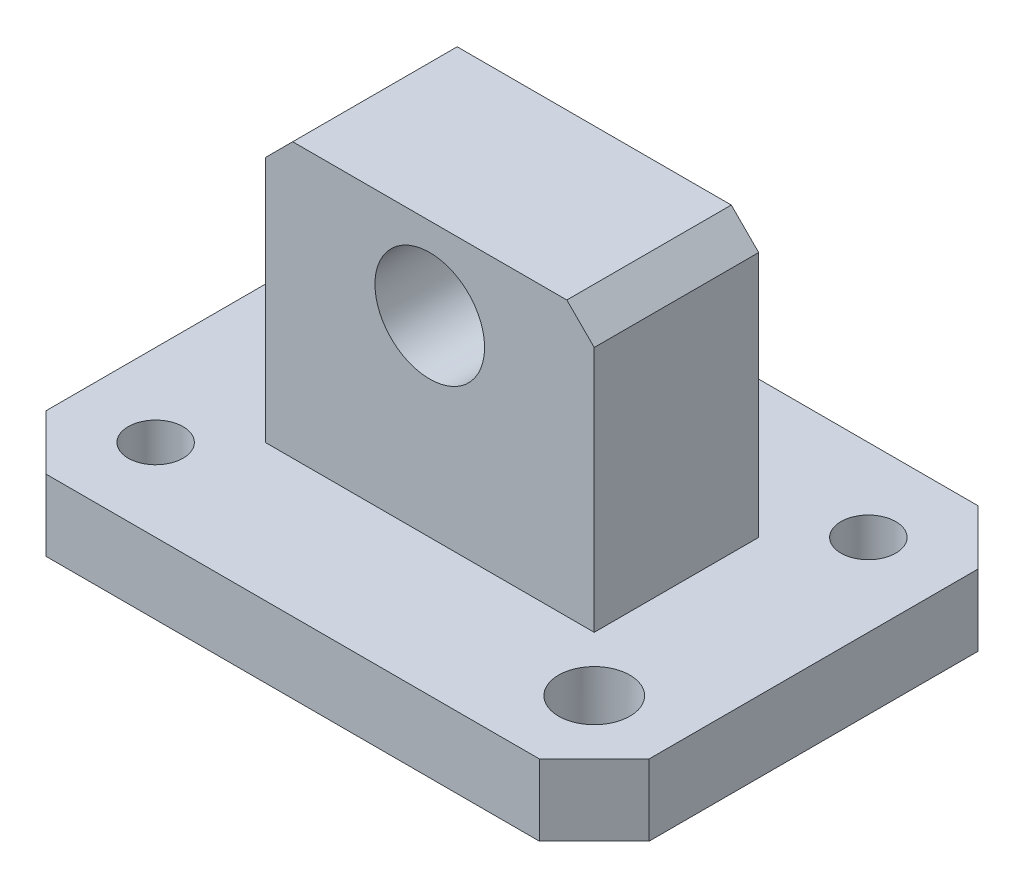
ISO-10303-21;
HEADER;
FILE_DESCRIPTION(('STEP AP214'),'2;1');
FILE_NAME('part.step','',(''),(''),'','','');
FILE_SCHEMA(('AUTOMOTIVE_DESIGN { 1 0 10303 214 1 1 1 1 }'));
ENDSEC;
DATA;
#1=APPLICATION_CONTEXT('core data for automotive mechanical design processes');
#2=APPLICATION_PROTOCOL_DEFINITION('international standard','automotive_design',2000,#1);
#3=PRODUCT_CONTEXT('',#1,'mechanical');
#4=PRODUCT('Part','Part','',(#3));
#5=PRODUCT_RELATED_PRODUCT_CATEGORY('part','',(#4));
#6=PRODUCT_DEFINITION_FORMATION('','',#4);
#7=PRODUCT_DEFINITION_CONTEXT('part definition',#1,'design');
#8=PRODUCT_DEFINITION('design','',#6,#7);
#9=PRODUCT_DEFINITION_SHAPE('','',#8);
#10=(LENGTH_UNIT() NAMED_UNIT(*) SI_UNIT(.MILLI.,.METRE.));
#11=(NAMED_UNIT(*) PLANE_ANGLE_UNIT() SI_UNIT($,.RADIAN.));
#12=(NAMED_UNIT(*) SI_UNIT($,.STERADIAN.) SOLID_ANGLE_UNIT());
#13=UNCERTAINTY_MEASURE_WITH_UNIT(LENGTH_MEASURE(1.E-05),#10,'distance_accuracy_value','');
#14=(GEOMETRIC_REPRESENTATION_CONTEXT(3) GLOBAL_UNCERTAINTY_ASSIGNED_CONTEXT((#13)) GLOBAL_UNIT_ASSIGNED_CONTEXT((#10,
#11,#12)) REPRESENTATION_CONTEXT('',''));
#15=CARTESIAN_POINT('',(0.,0.,0.));
#16=DIRECTION('',(0.,0.,1.));
#17=DIRECTION('',(1.,0.,0.));
#18=AXIS2_PLACEMENT_3D('',#15,#16,#17);
#19=CARTESIAN_POINT('',(0.,13.,0.));
#20=DIRECTION('',(0.,-1.,0.));
#21=DIRECTION('',(0.,0.,-1.));
#22=AXIS2_PLACEMENT_3D('',#19,#20,#21);
#23=PLANE('',#22);
#24=CARTESIAN_POINT('',(15.,13.,-15.));
#25=DIRECTION('',(0.,1.,0.));
#26=DIRECTION('',(0.,0.,1.));
#27=AXIS2_PLACEMENT_3D('',#24,#25,#26);
#28=CIRCLE('',#27,5.);
#29=CARTESIAN_POINT('',(15.,13.,-10.));
#30=VERTEX_POINT('',#29);
#31=EDGE_CURVE('E373',#30,#30,#28,.T.);
#32=ORIENTED_EDGE('',*,*,#31,.F.);
#33=EDGE_LOOP('',(#32));
#34=FACE_BOUND('',#33,.T.);
#35=CARTESIAN_POINT('',(95.,13.,-65.));
#36=DIRECTION('',(0.,1.,0.));
#37=DIRECTION('',(0.,0.,1.));
#38=AXIS2_PLACEMENT_3D('',#35,#36,#37);
#39=CIRCLE('',#38,5.00000000000001);
#40=CARTESIAN_POINT('',(95.,13.,-60.));
#41=VERTEX_POINT('',#40);
#42=EDGE_CURVE('E376',#41,#41,#39,.T.);
#43=ORIENTED_EDGE('',*,*,#42,.F.);
#44=EDGE_LOOP('',(#43));
#45=FACE_BOUND('',#44,.T.);
#46=CARTESIAN_POINT('',(95.,13.,-15.));
#47=DIRECTION('',(0.,1.,0.));
#48=DIRECTION('',(0.,0.,1.));
#49=AXIS2_PLACEMENT_3D('',#46,#47,#48);
#50=CIRCLE('',#49,6.5);
#51=CARTESIAN_POINT('',(95.,13.,-8.5));
#52=VERTEX_POINT('',#51);
#53=EDGE_CURVE('E372',#52,#52,#50,.T.);
#54=ORIENTED_EDGE('',*,*,#53,.F.);
#55=EDGE_LOOP('',(#54));
#56=FACE_BOUND('',#55,.T.);
#57=CARTESIAN_POINT('',(15.,13.,-65.));
#58=DIRECTION('',(0.,1.,0.));
#59=DIRECTION('',(0.,0.,1.));
#60=AXIS2_PLACEMENT_3D('',#57,#58,#59);
#61=CIRCLE('',#60,6.5);
#62=CARTESIAN_POINT('',(15.,13.,-58.5));
#63=VERTEX_POINT('',#62);
#64=EDGE_CURVE('E261',#63,#63,#61,.T.);
#65=ORIENTED_EDGE('',*,*,#64,.F.);
#66=EDGE_LOOP('',(#65));
#67=FACE_BOUND('',#66,.T.);
#68=DIRECTION('',(0.,0.,1.));
#69=VECTOR('',#68,1.);
#70=CARTESIAN_POINT('',(0.,13.,-10.));
#71=LINE('',#70,#69);
#72=CARTESIAN_POINT('',(0.,13.,-70.));
#73=VERTEX_POINT('',#72);
#74=CARTESIAN_POINT('',(0.,13.,-10.));
#75=VERTEX_POINT('',#74);
#76=EDGE_CURVE('E187',#73,#75,#71,.T.);
#77=ORIENTED_EDGE('',*,*,#76,.T.);
#78=DIRECTION('',(0.707106781186548,0.,0.707106781186548));
#79=VECTOR('',#78,1.);
#80=CARTESIAN_POINT('',(10.,13.,0.));
#81=LINE('',#80,#79);
#82=CARTESIAN_POINT('',(10.,13.,0.));
#83=VERTEX_POINT('',#82);
#84=EDGE_CURVE('E190',#75,#83,#81,.T.);
#85=ORIENTED_EDGE('',*,*,#84,.T.);
#86=DIRECTION('',(1.,0.,0.));
#87=VECTOR('',#86,1.);
#88=CARTESIAN_POINT('',(10.,13.,0.));
#89=LINE('',#88,#87);
#90=CARTESIAN_POINT('',(100.,13.,0.));
#91=VERTEX_POINT('',#90);
#92=EDGE_CURVE('E193',#83,#91,#89,.T.);
#93=ORIENTED_EDGE('',*,*,#92,.T.);
#94=DIRECTION('',(0.707106781186547,0.,-0.707106781186548));
#95=VECTOR('',#94,1.);
#96=CARTESIAN_POINT('',(100.,13.,0.));
#97=LINE('',#96,#95);
#98=CARTESIAN_POINT('',(110.,13.,-10.));
#99=VERTEX_POINT('',#98);
#100=EDGE_CURVE('E195',#91,#99,#97,.T.);
#101=ORIENTED_EDGE('',*,*,#100,.T.);
#102=DIRECTION('',(0.,0.,-1.));
#103=VECTOR('',#102,1.);
#104=CARTESIAN_POINT('',(110.,13.,-10.));
#105=LINE('',#104,#103);
#106=CARTESIAN_POINT('',(110.,13.,-70.));
#107=VERTEX_POINT('',#106);
#108=EDGE_CURVE('E197',#99,#107,#105,.T.);
#109=ORIENTED_EDGE('',*,*,#108,.T.);
#110=DIRECTION('',(-0.707106781186547,0.,-0.707106781186547));
#111=VECTOR('',#110,1.);
#112=CARTESIAN_POINT('',(110.,13.,-70.));
#113=LINE('',#112,#111);
#114=CARTESIAN_POINT('',(100.,13.,-80.));
#115=VERTEX_POINT('',#114);
#116=EDGE_CURVE('E199',#107,#115,#113,.T.);
#117=ORIENTED_EDGE('',*,*,#116,.T.);
#118=DIRECTION('',(-1.,0.,0.));
#119=VECTOR('',#118,1.);
#120=CARTESIAN_POINT('',(10.,13.,-80.));
#121=LINE('',#120,#119);
#122=CARTESIAN_POINT('',(10.,13.,-80.));
#123=VERTEX_POINT('',#122);
#124=EDGE_CURVE('E201',#115,#123,#121,.T.);
#125=ORIENTED_EDGE('',*,*,#124,.T.);
#126=DIRECTION('',(-0.707106781186548,0.,0.707106781186547));
#127=VECTOR('',#126,1.);
#128=CARTESIAN_POINT('',(0.,13.,-70.));
#129=LINE('',#128,#127);
#130=EDGE_CURVE('E203',#123,#73,#129,.T.);
#131=ORIENTED_EDGE('',*,*,#130,.T.);
#132=EDGE_LOOP('',(#77,#85,#93,#101,#109,#117,#125,#131));
#133=FACE_BOUND('',#132,.T.);
#134=DIRECTION('',(0.,0.,1.));
#135=VECTOR('',#134,1.);
#136=CARTESIAN_POINT('',(25.,13.,-55.));
#137=LINE('',#136,#135);
#138=CARTESIAN_POINT('',(25.,13.,-55.));
#139=VERTEX_POINT('',#138);
#140=CARTESIAN_POINT('',(25.,13.,-25.));
#141=VERTEX_POINT('',#140);
#142=EDGE_CURVE('E173',#139,#141,#137,.T.);
#143=ORIENTED_EDGE('',*,*,#142,.F.);
#144=DIRECTION('',(-1.,0.,0.));
#145=VECTOR('',#144,1.);
#146=CARTESIAN_POINT('',(25.,13.,-55.));
#147=LINE('',#146,#145);
#148=CARTESIAN_POINT('',(85.,13.,-55.));
#149=VERTEX_POINT('',#148);
#150=EDGE_CURVE('E169',#149,#139,#147,.T.);
#151=ORIENTED_EDGE('',*,*,#150,.F.);
#152=DIRECTION('',(0.,0.,-1.));
#153=VECTOR('',#152,1.);
#154=CARTESIAN_POINT('',(85.,13.,-55.));
#155=LINE('',#154,#153);
#156=CARTESIAN_POINT('',(85.,13.,-25.));
#157=VERTEX_POINT('',#156);
#158=EDGE_CURVE('E154',#157,#149,#155,.T.);
#159=ORIENTED_EDGE('',*,*,#158,.F.);
#160=DIRECTION('',(1.,0.,0.));
#161=VECTOR('',#160,1.);
#162=CARTESIAN_POINT('',(25.,13.,-25.));
#163=LINE('',#162,#161);
#164=EDGE_CURVE('E166',#141,#157,#163,.T.);
#165=ORIENTED_EDGE('',*,*,#164,.F.);
#166=EDGE_LOOP('',(#143,#151,#159,#165));
#167=FACE_BOUND('',#166,.T.);
#168=ADVANCED_FACE('F47',(#34,#45,#56,#67,#133,#167),#23,.F.);
#169=CARTESIAN_POINT('',(0.,13.,-10.));
#170=DIRECTION('',(1.,0.,0.));
#171=DIRECTION('',(0.,0.,-1.));
#172=AXIS2_PLACEMENT_3D('',#169,#170,#171);
#173=PLANE('',#172);
#174=DIRECTION('',(0.,0.,1.));
#175=VECTOR('',#174,1.);
#176=CARTESIAN_POINT('',(0.,0.,-10.));
#177=LINE('',#176,#175);
#178=CARTESIAN_POINT('',(0.,0.,-70.));
#179=VERTEX_POINT('',#178);
#180=CARTESIAN_POINT('',(0.,0.,-10.));
#181=VERTEX_POINT('',#180);
#182=EDGE_CURVE('E186',#179,#181,#177,.T.);
#183=ORIENTED_EDGE('',*,*,#182,.T.);
#184=DIRECTION('',(0.,-1.,0.));
#185=VECTOR('',#184,1.);
#186=CARTESIAN_POINT('',(0.,13.,-10.));
#187=LINE('',#186,#185);
#188=EDGE_CURVE('E241',#75,#181,#187,.T.);
#189=ORIENTED_EDGE('',*,*,#188,.F.);
#190=ORIENTED_EDGE('',*,*,#76,.F.);
#191=DIRECTION('',(0.,-1.,0.));
#192=VECTOR('',#191,1.);
#193=CARTESIAN_POINT('',(0.,13.,-70.));
#194=LINE('',#193,#192);
#195=EDGE_CURVE('E205',#73,#179,#194,.T.);
#196=ORIENTED_EDGE('',*,*,#195,.T.);
#197=EDGE_LOOP('',(#183,#189,#190,#196));
#198=FACE_BOUND('',#197,.T.);
#199=ADVANCED_FACE('F290',(#198),#173,.F.);
#200=CARTESIAN_POINT('',(10.,13.,0.));
#201=DIRECTION('',(0.707106781186548,0.,-0.707106781186548));
#202=DIRECTION('',(-0.707106781186548,0.,-0.707106781186548));
#203=AXIS2_PLACEMENT_3D('',#200,#201,#202);
#204=PLANE('',#203);
#205=DIRECTION('',(0.707106781186548,0.,0.707106781186548));
#206=VECTOR('',#205,1.);
#207=CARTESIAN_POINT('',(10.,0.,0.));
#208=LINE('',#207,#206);
#209=CARTESIAN_POINT('',(10.,0.,0.));
#210=VERTEX_POINT('',#209);
#211=EDGE_CURVE('E208',#181,#210,#208,.T.);
#212=ORIENTED_EDGE('',*,*,#211,.T.);
#213=DIRECTION('',(0.,-1.,0.));
#214=VECTOR('',#213,1.);
#215=CARTESIAN_POINT('',(10.,13.,0.));
#216=LINE('',#215,#214);
#217=EDGE_CURVE('E238',#83,#210,#216,.T.);
#218=ORIENTED_EDGE('',*,*,#217,.F.);
#219=ORIENTED_EDGE('',*,*,#84,.F.);
#220=ORIENTED_EDGE('',*,*,#188,.T.);
#221=EDGE_LOOP('',(#212,#218,#219,#220));
#222=FACE_BOUND('',#221,.T.);
#223=ADVANCED_FACE('F320',(#222),#204,.F.);
#224=CARTESIAN_POINT('',(10.,13.,0.));
#225=DIRECTION('',(0.,0.,-1.));
#226=DIRECTION('',(-1.,0.,0.));
#227=AXIS2_PLACEMENT_3D('',#224,#225,#226);
#228=PLANE('',#227);
#229=DIRECTION('',(1.,0.,0.));
#230=VECTOR('',#229,1.);
#231=CARTESIAN_POINT('',(10.,0.,0.));
#232=LINE('',#231,#230);
#233=CARTESIAN_POINT('',(100.,0.,0.));
#234=VERTEX_POINT('',#233);
#235=EDGE_CURVE('E210',#210,#234,#232,.T.);
#236=ORIENTED_EDGE('',*,*,#235,.T.);
#237=DIRECTION('',(0.,-1.,0.));
#238=VECTOR('',#237,1.);
#239=CARTESIAN_POINT('',(100.,13.,0.));
#240=LINE('',#239,#238);
#241=EDGE_CURVE('E235',#91,#234,#240,.T.);
#242=ORIENTED_EDGE('',*,*,#241,.F.);
#243=ORIENTED_EDGE('',*,*,#92,.F.);
#244=ORIENTED_EDGE('',*,*,#217,.T.);
#245=EDGE_LOOP('',(#236,#242,#243,#244));
#246=FACE_BOUND('',#245,.T.);
#247=ADVANCED_FACE('F316',(#246),#228,.F.);
#248=CARTESIAN_POINT('',(100.,13.,0.));
#249=DIRECTION('',(-0.707106781186548,0.,-0.707106781186547));
#250=DIRECTION('',(-0.707106781186547,0.,0.707106781186548));
#251=AXIS2_PLACEMENT_3D('',#248,#249,#250);
#252=PLANE('',#251);
#253=DIRECTION('',(0.707106781186547,0.,-0.707106781186548));
#254=VECTOR('',#253,1.);
#255=CARTESIAN_POINT('',(100.,0.,0.));
#256=LINE('',#255,#254);
#257=CARTESIAN_POINT('',(110.,0.,-10.));
#258=VERTEX_POINT('',#257);
#259=EDGE_CURVE('E212',#234,#258,#256,.T.);
#260=ORIENTED_EDGE('',*,*,#259,.T.);
#261=DIRECTION('',(0.,-1.,0.));
#262=VECTOR('',#261,1.);
#263=CARTESIAN_POINT('',(110.,13.,-10.));
#264=LINE('',#263,#262);
#265=EDGE_CURVE('E232',#99,#258,#264,.T.);
#266=ORIENTED_EDGE('',*,*,#265,.F.);
#267=ORIENTED_EDGE('',*,*,#100,.F.);
#268=ORIENTED_EDGE('',*,*,#241,.T.);
#269=EDGE_LOOP('',(#260,#266,#267,#268));
#270=FACE_BOUND('',#269,.T.);
#271=ADVANCED_FACE('F313',(#270),#252,.F.);
#272=CARTESIAN_POINT('',(110.,13.,-10.));
#273=DIRECTION('',(-1.,0.,0.));
#274=DIRECTION('',(0.,0.,1.));
#275=AXIS2_PLACEMENT_3D('',#272,#273,#274);
#276=PLANE('',#275);
#277=DIRECTION('',(0.,0.,-1.));
#278=VECTOR('',#277,1.);
#279=CARTESIAN_POINT('',(110.,0.,-10.));
#280=LINE('',#279,#278);
#281=CARTESIAN_POINT('',(110.,0.,-70.));
#282=VERTEX_POINT('',#281);
#283=EDGE_CURVE('E214',#258,#282,#280,.T.);
#284=ORIENTED_EDGE('',*,*,#283,.T.);
#285=DIRECTION('',(0.,-1.,0.));
#286=VECTOR('',#285,1.);
#287=CARTESIAN_POINT('',(110.,13.,-70.));
#288=LINE('',#287,#286);
#289=EDGE_CURVE('E229',#107,#282,#288,.T.);
#290=ORIENTED_EDGE('',*,*,#289,.F.);
#291=ORIENTED_EDGE('',*,*,#108,.F.);
#292=ORIENTED_EDGE('',*,*,#265,.T.);
#293=EDGE_LOOP('',(#284,#290,#291,#292));
#294=FACE_BOUND('',#293,.T.);
#295=ADVANCED_FACE('F309',(#294),#276,.F.);
#296=CARTESIAN_POINT('',(110.,13.,-70.));
#297=DIRECTION('',(-0.707106781186548,0.,0.707106781186548));
#298=DIRECTION('',(0.707106781186548,0.,0.707106781186548));
#299=AXIS2_PLACEMENT_3D('',#296,#297,#298);
#300=PLANE('',#299);
#301=DIRECTION('',(-0.707106781186547,0.,-0.707106781186547));
#302=VECTOR('',#301,1.);
#303=CARTESIAN_POINT('',(110.,0.,-70.));
#304=LINE('',#303,#302);
#305=CARTESIAN_POINT('',(100.,0.,-80.));
#306=VERTEX_POINT('',#305);
#307=EDGE_CURVE('E216',#282,#306,#304,.T.);
#308=ORIENTED_EDGE('',*,*,#307,.T.);
#309=DIRECTION('',(0.,-1.,0.));
#310=VECTOR('',#309,1.);
#311=CARTESIAN_POINT('',(100.,13.,-80.));
#312=LINE('',#311,#310);
#313=EDGE_CURVE('E226',#115,#306,#312,.T.);
#314=ORIENTED_EDGE('',*,*,#313,.F.);
#315=ORIENTED_EDGE('',*,*,#116,.F.);
#316=ORIENTED_EDGE('',*,*,#289,.T.);
#317=EDGE_LOOP('',(#308,#314,#315,#316));
#318=FACE_BOUND('',#317,.T.);
#319=ADVANCED_FACE('F304',(#318),#300,.F.);
#320=CARTESIAN_POINT('',(10.,13.,-80.));
#321=DIRECTION('',(0.,0.,1.));
#322=DIRECTION('',(1.,0.,0.));
#323=AXIS2_PLACEMENT_3D('',#320,#321,#322);
#324=PLANE('',#323);
#325=DIRECTION('',(-1.,0.,0.));
#326=VECTOR('',#325,1.);
#327=CARTESIAN_POINT('',(10.,0.,-80.));
#328=LINE('',#327,#326);
#329=CARTESIAN_POINT('',(10.,0.,-80.));
#330=VERTEX_POINT('',#329);
#331=EDGE_CURVE('E218',#306,#330,#328,.T.);
#332=ORIENTED_EDGE('',*,*,#331,.T.);
#333=DIRECTION('',(0.,-1.,0.));
#334=VECTOR('',#333,1.);
#335=CARTESIAN_POINT('',(10.,13.,-80.));
#336=LINE('',#335,#334);
#337=EDGE_CURVE('E223',#123,#330,#336,.T.);
#338=ORIENTED_EDGE('',*,*,#337,.F.);
#339=ORIENTED_EDGE('',*,*,#124,.F.);
#340=ORIENTED_EDGE('',*,*,#313,.T.);
#341=EDGE_LOOP('',(#332,#338,#339,#340));
#342=FACE_BOUND('',#341,.T.);
#343=ADVANCED_FACE('F298',(#342),#324,.F.);
#344=CARTESIAN_POINT('',(0.,13.,-70.));
#345=DIRECTION('',(0.707106781186547,0.,0.707106781186548));
#346=DIRECTION('',(0.707106781186548,0.,-0.707106781186547));
#347=AXIS2_PLACEMENT_3D('',#344,#345,#346);
#348=PLANE('',#347);
#349=DIRECTION('',(-0.707106781186548,0.,0.707106781186547));
#350=VECTOR('',#349,1.);
#351=CARTESIAN_POINT('',(0.,0.,-70.));
#352=LINE('',#351,#350);
#353=EDGE_CURVE('E191',#330,#179,#352,.T.);
#354=ORIENTED_EDGE('',*,*,#353,.T.);
#355=ORIENTED_EDGE('',*,*,#195,.F.);
#356=ORIENTED_EDGE('',*,*,#130,.F.);
#357=ORIENTED_EDGE('',*,*,#337,.T.);
#358=EDGE_LOOP('',(#354,#355,#356,#357));
#359=FACE_BOUND('',#358,.T.);
#360=ADVANCED_FACE('F276',(#359),#348,.F.);
#361=CARTESIAN_POINT('',(0.,0.,0.));
#362=DIRECTION('',(0.,-1.,0.));
#363=DIRECTION('',(0.,0.,-1.));
#364=AXIS2_PLACEMENT_3D('',#361,#362,#363);
#365=PLANE('',#364);
#366=CARTESIAN_POINT('',(15.,0.,-15.));
#367=DIRECTION('',(0.,-1.,0.));
#368=DIRECTION('',(0.,0.,-1.));
#369=AXIS2_PLACEMENT_3D('',#366,#367,#368);
#370=CIRCLE('',#369,5.);
#371=CARTESIAN_POINT('',(15.,0.,-20.));
#372=VERTEX_POINT('',#371);
#373=EDGE_CURVE('E175',#372,#372,#370,.T.);
#374=ORIENTED_EDGE('',*,*,#373,.F.);
#375=EDGE_LOOP('',(#374));
#376=FACE_BOUND('',#375,.T.);
#377=CARTESIAN_POINT('',(95.,0.,-65.));
#378=DIRECTION('',(0.,-1.,0.));
#379=DIRECTION('',(0.,0.,-1.));
#380=AXIS2_PLACEMENT_3D('',#377,#378,#379);
#381=CIRCLE('',#380,5.00000000000001);
#382=CARTESIAN_POINT('',(95.,0.,-70.));
#383=VERTEX_POINT('',#382);
#384=EDGE_CURVE('E264',#383,#383,#381,.T.);
#385=ORIENTED_EDGE('',*,*,#384,.F.);
#386=EDGE_LOOP('',(#385));
#387=FACE_BOUND('',#386,.T.);
#388=CARTESIAN_POINT('',(95.,0.,-15.));
#389=DIRECTION('',(0.,-1.,0.));
#390=DIRECTION('',(0.,0.,-1.));
#391=AXIS2_PLACEMENT_3D('',#388,#389,#390);
#392=CIRCLE('',#391,6.5);
#393=CARTESIAN_POINT('',(95.,0.,-21.5));
#394=VERTEX_POINT('',#393);
#395=EDGE_CURVE('E260',#394,#394,#392,.T.);
#396=ORIENTED_EDGE('',*,*,#395,.F.);
#397=EDGE_LOOP('',(#396));
#398=FACE_BOUND('',#397,.T.);
#399=CARTESIAN_POINT('',(15.,0.,-65.));
#400=DIRECTION('',(0.,-1.,0.));
#401=DIRECTION('',(0.,0.,-1.));
#402=AXIS2_PLACEMENT_3D('',#399,#400,#401);
#403=CIRCLE('',#402,6.5);
#404=CARTESIAN_POINT('',(15.,0.,-71.5));
#405=VERTEX_POINT('',#404);
#406=EDGE_CURVE('E257',#405,#405,#403,.T.);
#407=ORIENTED_EDGE('',*,*,#406,.F.);
#408=EDGE_LOOP('',(#407));
#409=FACE_BOUND('',#408,.T.);
#410=ORIENTED_EDGE('',*,*,#182,.F.);
#411=ORIENTED_EDGE('',*,*,#353,.F.);
#412=ORIENTED_EDGE('',*,*,#331,.F.);
#413=ORIENTED_EDGE('',*,*,#307,.F.);
#414=ORIENTED_EDGE('',*,*,#283,.F.);
#415=ORIENTED_EDGE('',*,*,#259,.F.);
#416=ORIENTED_EDGE('',*,*,#235,.F.);
#417=ORIENTED_EDGE('',*,*,#211,.F.);
#418=EDGE_LOOP('',(#410,#411,#412,#413,#414,#415,#416,#417));
#419=FACE_BOUND('',#418,.T.);
#420=ADVANCED_FACE('F272',(#376,#387,#398,#409,#419),#365,.T.);
#421=CARTESIAN_POINT('',(25.,63.,-55.));
#422=DIRECTION('',(1.,0.,0.));
#423=DIRECTION('',(0.,0.,-1.));
#424=AXIS2_PLACEMENT_3D('',#421,#422,#423);
#425=PLANE('',#424);
#426=DIRECTION('',(0.,-1.,0.));
#427=VECTOR('',#426,1.);
#428=CARTESIAN_POINT('',(25.,63.,-25.));
#429=LINE('',#428,#427);
#430=CARTESIAN_POINT('',(25.,58.,-25.));
#431=VERTEX_POINT('',#430);
#432=EDGE_CURVE('E159',#431,#141,#429,.T.);
#433=ORIENTED_EDGE('',*,*,#432,.F.);
#434=DIRECTION('',(0.,0.,-1.));
#435=VECTOR('',#434,1.);
#436=CARTESIAN_POINT('',(25.,58.,-55.));
#437=LINE('',#436,#435);
#438=CARTESIAN_POINT('',(25.,58.,-55.));
#439=VERTEX_POINT('',#438);
#440=EDGE_CURVE('E73',#431,#439,#437,.T.);
#441=ORIENTED_EDGE('',*,*,#440,.T.);
#442=DIRECTION('',(0.,-1.,0.));
#443=VECTOR('',#442,1.);
#444=CARTESIAN_POINT('',(25.,63.,-55.));
#445=LINE('',#444,#443);
#446=EDGE_CURVE('E181',#439,#139,#445,.T.);
#447=ORIENTED_EDGE('',*,*,#446,.T.);
#448=ORIENTED_EDGE('',*,*,#142,.T.);
#449=EDGE_LOOP('',(#433,#441,#447,#448));
#450=FACE_BOUND('',#449,.T.);
#451=ADVANCED_FACE('F275',(#450),#425,.F.);
#452=CARTESIAN_POINT('',(25.,63.,-25.));
#453=DIRECTION('',(0.,0.,-1.));
#454=DIRECTION('',(-1.,0.,0.));
#455=AXIS2_PLACEMENT_3D('',#452,#453,#454);
#456=PLANE('',#455);
#457=CARTESIAN_POINT('',(55.,48.,-25.));
#458=DIRECTION('',(0.,0.,1.));
#459=DIRECTION('',(1.,0.,0.));
#460=AXIS2_PLACEMENT_3D('',#457,#458,#459);
#461=CIRCLE('',#460,9.99999999999999);
#462=CARTESIAN_POINT('',(65.,48.,-25.));
#463=VERTEX_POINT('',#462);
#464=EDGE_CURVE('E381',#463,#463,#461,.T.);
#465=ORIENTED_EDGE('',*,*,#464,.F.);
#466=EDGE_LOOP('',(#465));
#467=FACE_BOUND('',#466,.T.);
#468=DIRECTION('',(1.,0.,0.));
#469=VECTOR('',#468,1.);
#470=CARTESIAN_POINT('',(25.,63.,-25.));
#471=LINE('',#470,#469);
#472=CARTESIAN_POINT('',(30.,63.,-25.));
#473=VERTEX_POINT('',#472);
#474=CARTESIAN_POINT('',(80.,63.,-25.));
#475=VERTEX_POINT('',#474);
#476=EDGE_CURVE('E180',#473,#475,#471,.T.);
#477=ORIENTED_EDGE('',*,*,#476,.F.);
#478=DIRECTION('',(-0.707106781186546,-0.707106781186549,0.));
#479=VECTOR('',#478,1.);
#480=CARTESIAN_POINT('',(30.,63.,-25.));
#481=LINE('',#480,#479);
#482=EDGE_CURVE('E252',#473,#431,#481,.T.);
#483=ORIENTED_EDGE('',*,*,#482,.T.);
#484=ORIENTED_EDGE('',*,*,#432,.T.);
#485=ORIENTED_EDGE('',*,*,#164,.T.);
#486=DIRECTION('',(0.,-1.,0.));
#487=VECTOR('',#486,1.);
#488=CARTESIAN_POINT('',(85.,63.,-25.));
#489=LINE('',#488,#487);
#490=CARTESIAN_POINT('',(85.,58.,-25.));
#491=VERTEX_POINT('',#490);
#492=EDGE_CURVE('E151',#491,#157,#489,.T.);
#493=ORIENTED_EDGE('',*,*,#492,.F.);
#494=DIRECTION('',(-0.707106781186548,0.707106781186547,0.));
#495=VECTOR('',#494,1.);
#496=CARTESIAN_POINT('',(80.,63.,-25.));
#497=LINE('',#496,#495);
#498=EDGE_CURVE('E250',#491,#475,#497,.T.);
#499=ORIENTED_EDGE('',*,*,#498,.T.);
#500=EDGE_LOOP('',(#477,#483,#484,#485,#493,#499));
#501=FACE_BOUND('',#500,.T.);
#502=ADVANCED_FACE('F172',(#467,#501),#456,.F.);
#503=CARTESIAN_POINT('',(85.,63.,-55.));
#504=DIRECTION('',(-1.,0.,0.));
#505=DIRECTION('',(0.,0.,1.));
#506=AXIS2_PLACEMENT_3D('',#503,#504,#505);
#507=PLANE('',#506);
#508=DIRECTION('',(0.,-1.,0.));
#509=VECTOR('',#508,1.);
#510=CARTESIAN_POINT('',(85.,63.,-55.));
#511=LINE('',#510,#509);
#512=CARTESIAN_POINT('',(85.,58.,-55.));
#513=VERTEX_POINT('',#512);
#514=EDGE_CURVE('E160',#513,#149,#511,.T.);
#515=ORIENTED_EDGE('',*,*,#514,.F.);
#516=DIRECTION('',(0.,0.,1.));
#517=VECTOR('',#516,1.);
#518=CARTESIAN_POINT('',(85.,58.,-25.));
#519=LINE('',#518,#517);
#520=EDGE_CURVE('E11',#513,#491,#519,.T.);
#521=ORIENTED_EDGE('',*,*,#520,.T.);
#522=ORIENTED_EDGE('',*,*,#492,.T.);
#523=ORIENTED_EDGE('',*,*,#158,.T.);
#524=EDGE_LOOP('',(#515,#521,#522,#523));
#525=FACE_BOUND('',#524,.T.);
#526=ADVANCED_FACE('F153',(#525),#507,.F.);
#527=CARTESIAN_POINT('',(25.,63.,-55.));
#528=DIRECTION('',(0.,0.,1.));
#529=DIRECTION('',(1.,0.,0.));
#530=AXIS2_PLACEMENT_3D('',#527,#528,#529);
#531=PLANE('',#530);
#532=CARTESIAN_POINT('',(55.,48.,-55.));
#533=DIRECTION('',(0.,0.,1.));
#534=DIRECTION('',(1.,0.,0.));
#535=AXIS2_PLACEMENT_3D('',#532,#533,#534);
#536=CIRCLE('',#535,9.99999999999999);
#537=CARTESIAN_POINT('',(65.,48.,-55.));
#538=VERTEX_POINT('',#537);
#539=EDGE_CURVE('E52',#538,#538,#536,.T.);
#540=ORIENTED_EDGE('',*,*,#539,.T.);
#541=EDGE_LOOP('',(#540));
#542=FACE_BOUND('',#541,.T.);
#543=ORIENTED_EDGE('',*,*,#446,.F.);
#544=DIRECTION('',(0.707106781186546,0.707106781186549,0.));
#545=VECTOR('',#544,1.);
#546=CARTESIAN_POINT('',(30.,63.,-55.));
#547=LINE('',#546,#545);
#548=CARTESIAN_POINT('',(30.,63.,-55.));
#549=VERTEX_POINT('',#548);
#550=EDGE_CURVE('E57',#439,#549,#547,.T.);
#551=ORIENTED_EDGE('',*,*,#550,.T.);
#552=DIRECTION('',(-1.,0.,0.));
#553=VECTOR('',#552,1.);
#554=CARTESIAN_POINT('',(25.,63.,-55.));
#555=LINE('',#554,#553);
#556=CARTESIAN_POINT('',(80.,63.,-55.));
#557=VERTEX_POINT('',#556);
#558=EDGE_CURVE('E183',#557,#549,#555,.T.);
#559=ORIENTED_EDGE('',*,*,#558,.F.);
#560=DIRECTION('',(0.707106781186548,-0.707106781186547,0.));
#561=VECTOR('',#560,1.);
#562=CARTESIAN_POINT('',(80.,63.,-55.));
#563=LINE('',#562,#561);
#564=EDGE_CURVE('E65',#557,#513,#563,.T.);
#565=ORIENTED_EDGE('',*,*,#564,.T.);
#566=ORIENTED_EDGE('',*,*,#514,.T.);
#567=ORIENTED_EDGE('',*,*,#150,.T.);
#568=EDGE_LOOP('',(#543,#551,#559,#565,#566,#567));
#569=FACE_BOUND('',#568,.T.);
#570=ADVANCED_FACE('F360',(#542,#569),#531,.F.);
#571=CARTESIAN_POINT('',(0.,63.,0.));
#572=DIRECTION('',(0.,1.,0.));
#573=DIRECTION('',(0.,0.,1.));
#574=AXIS2_PLACEMENT_3D('',#571,#572,#573);
#575=PLANE('',#574);
#576=ORIENTED_EDGE('',*,*,#558,.T.);
#577=DIRECTION('',(0.,0.,1.));
#578=VECTOR('',#577,1.);
#579=CARTESIAN_POINT('',(30.,63.,-25.));
#580=LINE('',#579,#578);
#581=EDGE_CURVE('E247',#549,#473,#580,.T.);
#582=ORIENTED_EDGE('',*,*,#581,.T.);
#583=ORIENTED_EDGE('',*,*,#476,.T.);
#584=DIRECTION('',(0.,0.,-1.));
#585=VECTOR('',#584,1.);
#586=CARTESIAN_POINT('',(80.,63.,-55.));
#587=LINE('',#586,#585);
#588=EDGE_CURVE('E244',#475,#557,#587,.T.);
#589=ORIENTED_EDGE('',*,*,#588,.T.);
#590=EDGE_LOOP('',(#576,#582,#583,#589));
#591=FACE_BOUND('',#590,.T.);
#592=ADVANCED_FACE('F353',(#591),#575,.T.);
#593=CARTESIAN_POINT('',(30.,63.,0.));
#594=DIRECTION('',(-0.707106781186549,0.707106781186546,0.));
#595=DIRECTION('',(0.,0.,-1.));
#596=AXIS2_PLACEMENT_3D('',#593,#594,#595);
#597=PLANE('',#596);
#598=ORIENTED_EDGE('',*,*,#550,.F.);
#599=ORIENTED_EDGE('',*,*,#440,.F.);
#600=ORIENTED_EDGE('',*,*,#482,.F.);
#601=ORIENTED_EDGE('',*,*,#581,.F.);
#602=EDGE_LOOP('',(#598,#599,#600,#601));
#603=FACE_BOUND('',#602,.T.);
#604=ADVANCED_FACE('F349',(#603),#597,.T.);
#605=CARTESIAN_POINT('',(80.,63.,0.));
#606=DIRECTION('',(0.707106781186547,0.707106781186548,0.));
#607=DIRECTION('',(0.,0.,1.));
#608=AXIS2_PLACEMENT_3D('',#605,#606,#607);
#609=PLANE('',#608);
#610=ORIENTED_EDGE('',*,*,#498,.F.);
#611=ORIENTED_EDGE('',*,*,#520,.F.);
#612=ORIENTED_EDGE('',*,*,#564,.F.);
#613=ORIENTED_EDGE('',*,*,#588,.F.);
#614=EDGE_LOOP('',(#610,#611,#612,#613));
#615=FACE_BOUND('',#614,.T.);
#616=ADVANCED_FACE('F50',(#615),#609,.T.);
#617=CARTESIAN_POINT('',(15.,-37.,-65.));
#618=DIRECTION('',(0.,1.,0.));
#619=DIRECTION('',(0.,0.,1.));
#620=AXIS2_PLACEMENT_3D('',#617,#618,#619);
#621=CYLINDRICAL_SURFACE('',#620,6.5);
#622=ORIENTED_EDGE('',*,*,#406,.T.);
#623=EDGE_LOOP('',(#622));
#624=FACE_BOUND('',#623,.T.);
#625=ORIENTED_EDGE('',*,*,#64,.T.);
#626=EDGE_LOOP('',(#625));
#627=FACE_BOUND('',#626,.T.);
#628=ADVANCED_FACE('F358',(#624,#627),#621,.F.);
#629=CARTESIAN_POINT('',(95.,-37.,-15.));
#630=DIRECTION('',(0.,1.,0.));
#631=DIRECTION('',(0.,0.,1.));
#632=AXIS2_PLACEMENT_3D('',#629,#630,#631);
#633=CYLINDRICAL_SURFACE('',#632,6.5);
#634=ORIENTED_EDGE('',*,*,#395,.T.);
#635=EDGE_LOOP('',(#634));
#636=FACE_BOUND('',#635,.T.);
#637=ORIENTED_EDGE('',*,*,#53,.T.);
#638=EDGE_LOOP('',(#637));
#639=FACE_BOUND('',#638,.T.);
#640=ADVANCED_FACE('F399',(#636,#639),#633,.F.);
#641=CARTESIAN_POINT('',(95.,-37.,-65.));
#642=DIRECTION('',(0.,1.,0.));
#643=DIRECTION('',(0.,0.,1.));
#644=AXIS2_PLACEMENT_3D('',#641,#642,#643);
#645=CYLINDRICAL_SURFACE('',#644,5.00000000000001);
#646=ORIENTED_EDGE('',*,*,#384,.T.);
#647=EDGE_LOOP('',(#646));
#648=FACE_BOUND('',#647,.T.);
#649=ORIENTED_EDGE('',*,*,#42,.T.);
#650=EDGE_LOOP('',(#649));
#651=FACE_BOUND('',#650,.T.);
#652=ADVANCED_FACE('F396',(#648,#651),#645,.F.);
#653=CARTESIAN_POINT('',(15.,-37.,-15.));
#654=DIRECTION('',(0.,1.,0.));
#655=DIRECTION('',(0.,0.,1.));
#656=AXIS2_PLACEMENT_3D('',#653,#654,#655);
#657=CYLINDRICAL_SURFACE('',#656,5.);
#658=ORIENTED_EDGE('',*,*,#373,.T.);
#659=EDGE_LOOP('',(#658));
#660=FACE_BOUND('',#659,.T.);
#661=ORIENTED_EDGE('',*,*,#31,.T.);
#662=EDGE_LOOP('',(#661));
#663=FACE_BOUND('',#662,.T.);
#664=ADVANCED_FACE('F269',(#660,#663),#657,.F.);
#665=CARTESIAN_POINT('',(55.,48.,-75.));
#666=DIRECTION('',(0.,0.,1.));
#667=DIRECTION('',(1.,0.,0.));
#668=AXIS2_PLACEMENT_3D('',#665,#666,#667);
#669=CYLINDRICAL_SURFACE('',#668,9.99999999999999);
#670=ORIENTED_EDGE('',*,*,#464,.T.);
#671=EDGE_LOOP('',(#670));
#672=FACE_BOUND('',#671,.T.);
#673=ORIENTED_EDGE('',*,*,#539,.F.);
#674=EDGE_LOOP('',(#673));
#675=FACE_BOUND('',#674,.T.);
#676=ADVANCED_FACE('F389',(#672,#675),#669,.F.);
#677=CLOSED_SHELL('',(#168,#199,#223,#247,#271,#295,#319,#343,#360,#420,#451,#502,#526,#570,
#592,#604,#616,#628,#640,#652,#664,#676));
#678=MANIFOLD_SOLID_BREP('B2',#677);
#679=ADVANCED_BREP_SHAPE_REPRESENTATION('',(#18,#678),#14);
#680=SHAPE_DEFINITION_REPRESENTATION(#9,#679);
ENDSEC;
END-ISO-10303-21;
